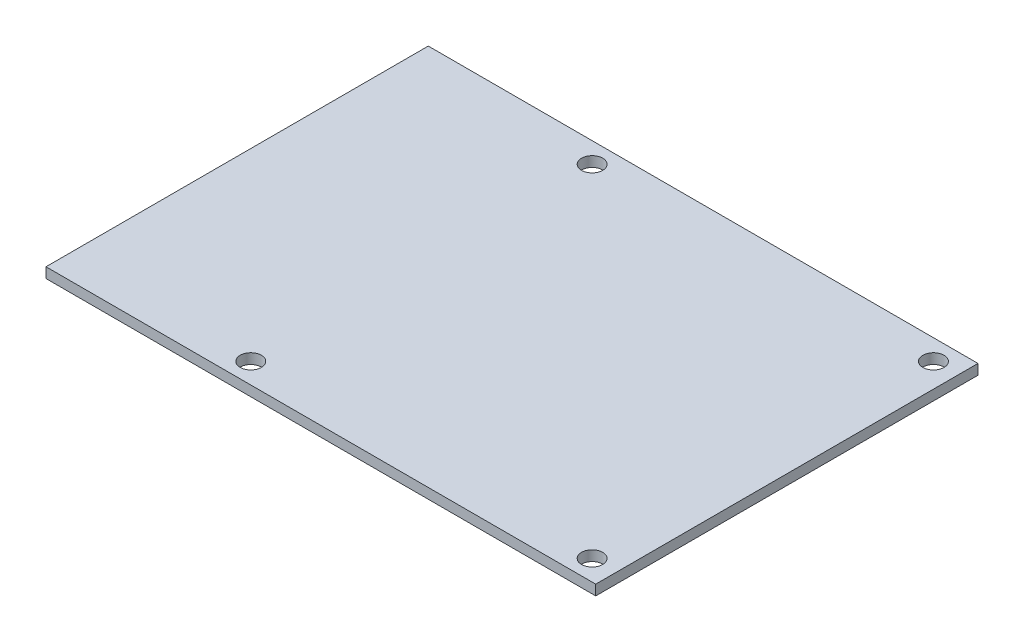
ISO-10303-21;
HEADER;
FILE_DESCRIPTION(('STEP AP214'),'2;1');
FILE_NAME('part.step','',(''),(''),'','','');
FILE_SCHEMA(('AUTOMOTIVE_DESIGN { 1 0 10303 214 1 1 1 1 }'));
ENDSEC;
DATA;
#1=APPLICATION_CONTEXT('core data for automotive mechanical design processes');
#2=APPLICATION_PROTOCOL_DEFINITION('international standard','automotive_design',2000,#1);
#3=PRODUCT_CONTEXT('',#1,'mechanical');
#4=PRODUCT('Part','Part','',(#3));
#5=PRODUCT_RELATED_PRODUCT_CATEGORY('part','',(#4));
#6=PRODUCT_DEFINITION_FORMATION('','',#4);
#7=PRODUCT_DEFINITION_CONTEXT('part definition',#1,'design');
#8=PRODUCT_DEFINITION('design','',#6,#7);
#9=PRODUCT_DEFINITION_SHAPE('','',#8);
#10=(LENGTH_UNIT() NAMED_UNIT(*) SI_UNIT(.MILLI.,.METRE.));
#11=(NAMED_UNIT(*) PLANE_ANGLE_UNIT() SI_UNIT($,.RADIAN.));
#12=(NAMED_UNIT(*) SI_UNIT($,.STERADIAN.) SOLID_ANGLE_UNIT());
#13=UNCERTAINTY_MEASURE_WITH_UNIT(LENGTH_MEASURE(1.E-05),#10,'distance_accuracy_value','');
#14=(GEOMETRIC_REPRESENTATION_CONTEXT(3) GLOBAL_UNCERTAINTY_ASSIGNED_CONTEXT((#13)) GLOBAL_UNIT_ASSIGNED_CONTEXT((#10,
#11,#12)) REPRESENTATION_CONTEXT('',''));
#15=CARTESIAN_POINT('',(0.,0.,0.));
#16=DIRECTION('',(0.,0.,1.));
#17=DIRECTION('',(1.,0.,0.));
#18=AXIS2_PLACEMENT_3D('',#15,#16,#17);
#19=CARTESIAN_POINT('',(0.,1.5,0.));
#20=DIRECTION('',(0.,1.,0.));
#21=DIRECTION('',(0.,0.,1.));
#22=AXIS2_PLACEMENT_3D('',#19,#20,#21);
#23=PLANE('',#22);
#24=CARTESIAN_POINT('',(40.4729760430365,1.5,25.));
#25=DIRECTION('',(0.,1.,0.));
#26=DIRECTION('',(0.,0.,1.));
#27=AXIS2_PLACEMENT_3D('',#24,#25,#26);
#28=CIRCLE('',#27,1.55);
#29=CARTESIAN_POINT('',(40.4729760430365,1.5,26.55));
#30=VERTEX_POINT('',#29);
#31=EDGE_CURVE('E123',#30,#30,#28,.T.);
#32=ORIENTED_EDGE('',*,*,#31,.F.);
#33=EDGE_LOOP('',(#32));
#34=FACE_BOUND('',#33,.T.);
#35=CARTESIAN_POINT('',(-9.52702395696351,1.5,-25.));
#36=DIRECTION('',(0.,1.,0.));
#37=DIRECTION('',(0.,0.,1.));
#38=AXIS2_PLACEMENT_3D('',#35,#36,#37);
#39=CIRCLE('',#38,1.55);
#40=CARTESIAN_POINT('',(-9.52702395696351,1.5,-23.45));
#41=VERTEX_POINT('',#40);
#42=EDGE_CURVE('E102',#41,#41,#39,.T.);
#43=ORIENTED_EDGE('',*,*,#42,.F.);
#44=EDGE_LOOP('',(#43));
#45=FACE_BOUND('',#44,.T.);
#46=DIRECTION('',(0.,0.,1.));
#47=VECTOR('',#46,1.);
#48=CARTESIAN_POINT('',(-36.5270239569635,1.5,28.));
#49=LINE('',#48,#47);
#50=CARTESIAN_POINT('',(-36.5270239569635,1.5,-28.));
#51=VERTEX_POINT('',#50);
#52=CARTESIAN_POINT('',(-36.5270239569635,1.5,28.));
#53=VERTEX_POINT('',#52);
#54=EDGE_CURVE('E87',#51,#53,#49,.T.);
#55=ORIENTED_EDGE('',*,*,#54,.T.);
#56=DIRECTION('',(1.,0.,0.));
#57=VECTOR('',#56,1.);
#58=CARTESIAN_POINT('',(44.,1.5,28.));
#59=LINE('',#58,#57);
#60=CARTESIAN_POINT('',(44.,1.5,28.));
#61=VERTEX_POINT('',#60);
#62=EDGE_CURVE('E82',#53,#61,#59,.T.);
#63=ORIENTED_EDGE('',*,*,#62,.T.);
#64=DIRECTION('',(0.,0.,-1.));
#65=VECTOR('',#64,1.);
#66=CARTESIAN_POINT('',(44.,1.5,28.));
#67=LINE('',#66,#65);
#68=CARTESIAN_POINT('',(44.,1.5,-28.));
#69=VERTEX_POINT('',#68);
#70=EDGE_CURVE('E85',#61,#69,#67,.T.);
#71=ORIENTED_EDGE('',*,*,#70,.T.);
#72=DIRECTION('',(-1.,0.,0.));
#73=VECTOR('',#72,1.);
#74=CARTESIAN_POINT('',(44.,1.5,-28.));
#75=LINE('',#74,#73);
#76=EDGE_CURVE('E52',#69,#51,#75,.T.);
#77=ORIENTED_EDGE('',*,*,#76,.T.);
#78=EDGE_LOOP('',(#55,#63,#71,#77));
#79=FACE_BOUND('',#78,.T.);
#80=CARTESIAN_POINT('',(-9.52702395696351,1.5,25.));
#81=DIRECTION('',(0.,1.,0.));
#82=DIRECTION('',(0.,0.,1.));
#83=AXIS2_PLACEMENT_3D('',#80,#81,#82);
#84=CIRCLE('',#83,1.55);
#85=CARTESIAN_POINT('',(-9.52702395696351,1.5,26.55));
#86=VERTEX_POINT('',#85);
#87=EDGE_CURVE('E117',#86,#86,#84,.T.);
#88=ORIENTED_EDGE('',*,*,#87,.F.);
#89=EDGE_LOOP('',(#88));
#90=FACE_BOUND('',#89,.T.);
#91=CARTESIAN_POINT('',(40.4729760430365,1.5,-25.));
#92=DIRECTION('',(0.,1.,0.));
#93=DIRECTION('',(0.,0.,1.));
#94=AXIS2_PLACEMENT_3D('',#91,#92,#93);
#95=CIRCLE('',#94,1.55);
#96=CARTESIAN_POINT('',(40.4729760430365,1.5,-23.45));
#97=VERTEX_POINT('',#96);
#98=EDGE_CURVE('E129',#97,#97,#95,.T.);
#99=ORIENTED_EDGE('',*,*,#98,.F.);
#100=EDGE_LOOP('',(#99));
#101=FACE_BOUND('',#100,.T.);
#102=ADVANCED_FACE('F35',(#34,#45,#79,#90,#101),#23,.T.);
#103=CARTESIAN_POINT('',(0.,0.,0.));
#104=DIRECTION('',(0.,1.,0.));
#105=DIRECTION('',(0.,0.,1.));
#106=AXIS2_PLACEMENT_3D('',#103,#104,#105);
#107=PLANE('',#106);
#108=DIRECTION('',(0.,0.,1.));
#109=VECTOR('',#108,1.);
#110=CARTESIAN_POINT('',(-36.5270239569635,0.,28.));
#111=LINE('',#110,#109);
#112=CARTESIAN_POINT('',(-36.5270239569635,0.,-28.));
#113=VERTEX_POINT('',#112);
#114=CARTESIAN_POINT('',(-36.5270239569635,0.,28.));
#115=VERTEX_POINT('',#114);
#116=EDGE_CURVE('E99',#113,#115,#111,.T.);
#117=ORIENTED_EDGE('',*,*,#116,.F.);
#118=DIRECTION('',(-1.,0.,0.));
#119=VECTOR('',#118,1.);
#120=CARTESIAN_POINT('',(44.,0.,-28.));
#121=LINE('',#120,#119);
#122=CARTESIAN_POINT('',(44.,0.,-28.));
#123=VERTEX_POINT('',#122);
#124=EDGE_CURVE('E75',#123,#113,#121,.T.);
#125=ORIENTED_EDGE('',*,*,#124,.F.);
#126=DIRECTION('',(0.,0.,-1.));
#127=VECTOR('',#126,1.);
#128=CARTESIAN_POINT('',(44.,0.,28.));
#129=LINE('',#128,#127);
#130=CARTESIAN_POINT('',(44.,0.,28.));
#131=VERTEX_POINT('',#130);
#132=EDGE_CURVE('E69',#131,#123,#129,.T.);
#133=ORIENTED_EDGE('',*,*,#132,.F.);
#134=DIRECTION('',(1.,0.,0.));
#135=VECTOR('',#134,1.);
#136=CARTESIAN_POINT('',(44.,0.,28.));
#137=LINE('',#136,#135);
#138=EDGE_CURVE('E91',#115,#131,#137,.T.);
#139=ORIENTED_EDGE('',*,*,#138,.F.);
#140=EDGE_LOOP('',(#117,#125,#133,#139));
#141=FACE_BOUND('',#140,.T.);
#142=CARTESIAN_POINT('',(-9.52702395696351,0.,-25.));
#143=DIRECTION('',(0.,1.,0.));
#144=DIRECTION('',(0.,0.,1.));
#145=AXIS2_PLACEMENT_3D('',#142,#143,#144);
#146=CIRCLE('',#145,1.55);
#147=CARTESIAN_POINT('',(-9.52702395696351,0.,-23.45));
#148=VERTEX_POINT('',#147);
#149=EDGE_CURVE('E114',#148,#148,#146,.T.);
#150=ORIENTED_EDGE('',*,*,#149,.T.);
#151=EDGE_LOOP('',(#150));
#152=FACE_BOUND('',#151,.T.);
#153=CARTESIAN_POINT('',(-9.52702395696351,0.,25.));
#154=DIRECTION('',(0.,1.,0.));
#155=DIRECTION('',(0.,0.,1.));
#156=AXIS2_PLACEMENT_3D('',#153,#154,#155);
#157=CIRCLE('',#156,1.55);
#158=CARTESIAN_POINT('',(-9.52702395696351,0.,26.55));
#159=VERTEX_POINT('',#158);
#160=EDGE_CURVE('E120',#159,#159,#157,.T.);
#161=ORIENTED_EDGE('',*,*,#160,.T.);
#162=EDGE_LOOP('',(#161));
#163=FACE_BOUND('',#162,.T.);
#164=CARTESIAN_POINT('',(40.4729760430365,0.,25.));
#165=DIRECTION('',(0.,1.,0.));
#166=DIRECTION('',(0.,0.,1.));
#167=AXIS2_PLACEMENT_3D('',#164,#165,#166);
#168=CIRCLE('',#167,1.55);
#169=CARTESIAN_POINT('',(40.4729760430365,0.,26.55));
#170=VERTEX_POINT('',#169);
#171=EDGE_CURVE('E126',#170,#170,#168,.T.);
#172=ORIENTED_EDGE('',*,*,#171,.T.);
#173=EDGE_LOOP('',(#172));
#174=FACE_BOUND('',#173,.T.);
#175=CARTESIAN_POINT('',(40.4729760430365,0.,-25.));
#176=DIRECTION('',(0.,1.,0.));
#177=DIRECTION('',(0.,0.,1.));
#178=AXIS2_PLACEMENT_3D('',#175,#176,#177);
#179=CIRCLE('',#178,1.55);
#180=CARTESIAN_POINT('',(40.4729760430365,0.,-23.45));
#181=VERTEX_POINT('',#180);
#182=EDGE_CURVE('E132',#181,#181,#179,.T.);
#183=ORIENTED_EDGE('',*,*,#182,.T.);
#184=EDGE_LOOP('',(#183));
#185=FACE_BOUND('',#184,.T.);
#186=ADVANCED_FACE('F110',(#141,#152,#163,#174,#185),#107,.F.);
#187=CARTESIAN_POINT('',(-36.5270239569635,1.5,28.));
#188=DIRECTION('',(1.,0.,0.));
#189=DIRECTION('',(0.,0.,-1.));
#190=AXIS2_PLACEMENT_3D('',#187,#188,#189);
#191=PLANE('',#190);
#192=ORIENTED_EDGE('',*,*,#116,.T.);
#193=DIRECTION('',(0.,-1.,0.));
#194=VECTOR('',#193,1.);
#195=CARTESIAN_POINT('',(-36.5270239569635,1.5,28.));
#196=LINE('',#195,#194);
#197=EDGE_CURVE('E11',#53,#115,#196,.T.);
#198=ORIENTED_EDGE('',*,*,#197,.F.);
#199=ORIENTED_EDGE('',*,*,#54,.F.);
#200=DIRECTION('',(0.,-1.,0.));
#201=VECTOR('',#200,1.);
#202=CARTESIAN_POINT('',(-36.5270239569635,1.5,-28.));
#203=LINE('',#202,#201);
#204=EDGE_CURVE('E95',#51,#113,#203,.T.);
#205=ORIENTED_EDGE('',*,*,#204,.T.);
#206=EDGE_LOOP('',(#192,#198,#199,#205));
#207=FACE_BOUND('',#206,.T.);
#208=ADVANCED_FACE('F37',(#207),#191,.F.);
#209=CARTESIAN_POINT('',(44.,1.5,28.));
#210=DIRECTION('',(0.,0.,-1.));
#211=DIRECTION('',(-1.,0.,0.));
#212=AXIS2_PLACEMENT_3D('',#209,#210,#211);
#213=PLANE('',#212);
#214=ORIENTED_EDGE('',*,*,#138,.T.);
#215=DIRECTION('',(0.,-1.,0.));
#216=VECTOR('',#215,1.);
#217=CARTESIAN_POINT('',(44.,1.5,28.));
#218=LINE('',#217,#216);
#219=EDGE_CURVE('E44',#61,#131,#218,.T.);
#220=ORIENTED_EDGE('',*,*,#219,.F.);
#221=ORIENTED_EDGE('',*,*,#62,.F.);
#222=ORIENTED_EDGE('',*,*,#197,.T.);
#223=EDGE_LOOP('',(#214,#220,#221,#222));
#224=FACE_BOUND('',#223,.T.);
#225=ADVANCED_FACE('F90',(#224),#213,.F.);
#226=CARTESIAN_POINT('',(44.,1.5,28.));
#227=DIRECTION('',(-1.,0.,0.));
#228=DIRECTION('',(0.,0.,1.));
#229=AXIS2_PLACEMENT_3D('',#226,#227,#228);
#230=PLANE('',#229);
#231=ORIENTED_EDGE('',*,*,#132,.T.);
#232=DIRECTION('',(0.,-1.,0.));
#233=VECTOR('',#232,1.);
#234=CARTESIAN_POINT('',(44.,1.5,-28.));
#235=LINE('',#234,#233);
#236=EDGE_CURVE('E92',#69,#123,#235,.T.);
#237=ORIENTED_EDGE('',*,*,#236,.F.);
#238=ORIENTED_EDGE('',*,*,#70,.F.);
#239=ORIENTED_EDGE('',*,*,#219,.T.);
#240=EDGE_LOOP('',(#231,#237,#238,#239));
#241=FACE_BOUND('',#240,.T.);
#242=ADVANCED_FACE('F93',(#241),#230,.F.);
#243=CARTESIAN_POINT('',(44.,1.5,-28.));
#244=DIRECTION('',(0.,0.,1.));
#245=DIRECTION('',(1.,0.,0.));
#246=AXIS2_PLACEMENT_3D('',#243,#244,#245);
#247=PLANE('',#246);
#248=ORIENTED_EDGE('',*,*,#124,.T.);
#249=ORIENTED_EDGE('',*,*,#204,.F.);
#250=ORIENTED_EDGE('',*,*,#76,.F.);
#251=ORIENTED_EDGE('',*,*,#236,.T.);
#252=EDGE_LOOP('',(#248,#249,#250,#251));
#253=FACE_BOUND('',#252,.T.);
#254=ADVANCED_FACE('F107',(#253),#247,.F.);
#255=CARTESIAN_POINT('',(-9.52702395696351,1.5,-25.));
#256=DIRECTION('',(0.,-1.,0.));
#257=DIRECTION('',(0.,0.,-1.));
#258=AXIS2_PLACEMENT_3D('',#255,#256,#257);
#259=CYLINDRICAL_SURFACE('',#258,1.55);
#260=ORIENTED_EDGE('',*,*,#42,.T.);
#261=EDGE_LOOP('',(#260));
#262=FACE_BOUND('',#261,.T.);
#263=ORIENTED_EDGE('',*,*,#149,.F.);
#264=EDGE_LOOP('',(#263));
#265=FACE_BOUND('',#264,.T.);
#266=ADVANCED_FACE('F151',(#262,#265),#259,.F.);
#267=CARTESIAN_POINT('',(-9.52702395696351,1.5,25.));
#268=DIRECTION('',(0.,-1.,0.));
#269=DIRECTION('',(0.,0.,-1.));
#270=AXIS2_PLACEMENT_3D('',#267,#268,#269);
#271=CYLINDRICAL_SURFACE('',#270,1.55);
#272=ORIENTED_EDGE('',*,*,#87,.T.);
#273=EDGE_LOOP('',(#272));
#274=FACE_BOUND('',#273,.T.);
#275=ORIENTED_EDGE('',*,*,#160,.F.);
#276=EDGE_LOOP('',(#275));
#277=FACE_BOUND('',#276,.T.);
#278=ADVANCED_FACE('F197',(#274,#277),#271,.F.);
#279=CARTESIAN_POINT('',(40.4729760430365,1.5,25.));
#280=DIRECTION('',(0.,-1.,0.));
#281=DIRECTION('',(0.,0.,-1.));
#282=AXIS2_PLACEMENT_3D('',#279,#280,#281);
#283=CYLINDRICAL_SURFACE('',#282,1.55);
#284=ORIENTED_EDGE('',*,*,#31,.T.);
#285=EDGE_LOOP('',(#284));
#286=FACE_BOUND('',#285,.T.);
#287=ORIENTED_EDGE('',*,*,#171,.F.);
#288=EDGE_LOOP('',(#287));
#289=FACE_BOUND('',#288,.T.);
#290=ADVANCED_FACE('F205',(#286,#289),#283,.F.);
#291=CARTESIAN_POINT('',(40.4729760430365,1.5,-25.));
#292=DIRECTION('',(0.,-1.,0.));
#293=DIRECTION('',(0.,0.,-1.));
#294=AXIS2_PLACEMENT_3D('',#291,#292,#293);
#295=CYLINDRICAL_SURFACE('',#294,1.55);
#296=ORIENTED_EDGE('',*,*,#98,.T.);
#297=EDGE_LOOP('',(#296));
#298=FACE_BOUND('',#297,.T.);
#299=ORIENTED_EDGE('',*,*,#182,.F.);
#300=EDGE_LOOP('',(#299));
#301=FACE_BOUND('',#300,.T.);
#302=ADVANCED_FACE('F138',(#298,#301),#295,.F.);
#303=CLOSED_SHELL('',(#102,#186,#208,#225,#242,#254,#266,#278,#290,#302));
#304=MANIFOLD_SOLID_BREP('B2',#303);
#305=ADVANCED_BREP_SHAPE_REPRESENTATION('',(#18,#304),#14);
#306=SHAPE_DEFINITION_REPRESENTATION(#9,#305);
ENDSEC;
END-ISO-10303-21;
